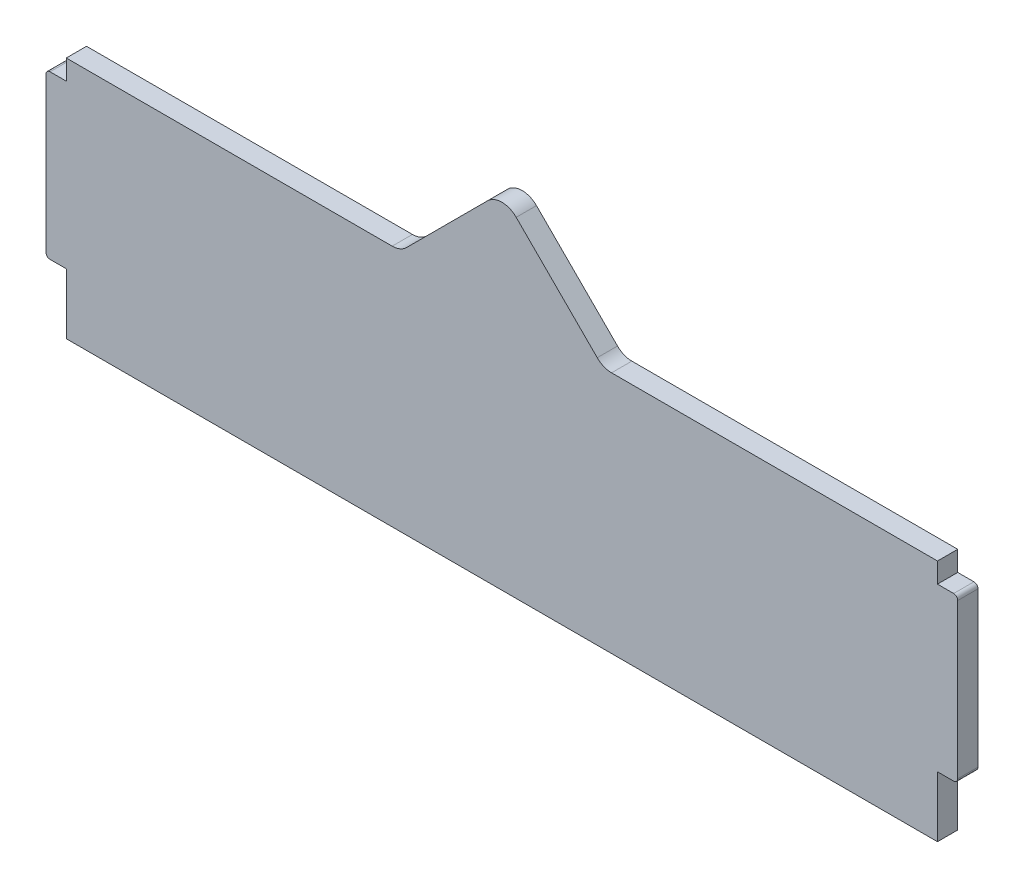
ISO-10303-21;
HEADER;
FILE_DESCRIPTION(('STEP AP214'),'2;1');
FILE_NAME('part.step','',(''),(''),'','','');
FILE_SCHEMA(('AUTOMOTIVE_DESIGN { 1 0 10303 214 1 1 1 1 }'));
ENDSEC;
DATA;
#1=APPLICATION_CONTEXT('core data for automotive mechanical design processes');
#2=APPLICATION_PROTOCOL_DEFINITION('international standard','automotive_design',2000,#1);
#3=PRODUCT_CONTEXT('',#1,'mechanical');
#4=PRODUCT('Part','Part','',(#3));
#5=PRODUCT_RELATED_PRODUCT_CATEGORY('part','',(#4));
#6=PRODUCT_DEFINITION_FORMATION('','',#4);
#7=PRODUCT_DEFINITION_CONTEXT('part definition',#1,'design');
#8=PRODUCT_DEFINITION('design','',#6,#7);
#9=PRODUCT_DEFINITION_SHAPE('','',#8);
#10=(LENGTH_UNIT() NAMED_UNIT(*) SI_UNIT(.MILLI.,.METRE.));
#11=(NAMED_UNIT(*) PLANE_ANGLE_UNIT() SI_UNIT($,.RADIAN.));
#12=(NAMED_UNIT(*) SI_UNIT($,.STERADIAN.) SOLID_ANGLE_UNIT());
#13=UNCERTAINTY_MEASURE_WITH_UNIT(LENGTH_MEASURE(1.E-05),#10,'distance_accuracy_value','');
#14=(GEOMETRIC_REPRESENTATION_CONTEXT(3) GLOBAL_UNCERTAINTY_ASSIGNED_CONTEXT((#13)) GLOBAL_UNIT_ASSIGNED_CONTEXT((#10,
#11,#12)) REPRESENTATION_CONTEXT('',''));
#15=CARTESIAN_POINT('',(0.,0.,0.));
#16=DIRECTION('',(0.,0.,1.));
#17=DIRECTION('',(1.,0.,0.));
#18=AXIS2_PLACEMENT_3D('',#15,#16,#17);
#19=CARTESIAN_POINT('',(0.,0.,5.));
#20=DIRECTION('',(1.,0.,0.));
#21=DIRECTION('',(0.,0.,-1.));
#22=AXIS2_PLACEMENT_3D('',#19,#20,#21);
#23=PLANE('',#22);
#24=DIRECTION('',(0.,-1.,0.));
#25=VECTOR('',#24,1.);
#26=CARTESIAN_POINT('',(0.,0.,0.));
#27=LINE('',#26,#25);
#28=CARTESIAN_POINT('',(0.,14.95,0.));
#29=VERTEX_POINT('',#28);
#30=CARTESIAN_POINT('',(0.,0.,0.));
#31=VERTEX_POINT('',#30);
#32=EDGE_CURVE('E211',#29,#31,#27,.T.);
#33=ORIENTED_EDGE('',*,*,#32,.T.);
#34=DIRECTION('',(0.,0.,-1.));
#35=VECTOR('',#34,1.);
#36=CARTESIAN_POINT('',(0.,0.,5.));
#37=LINE('',#36,#35);
#38=CARTESIAN_POINT('',(0.,0.,5.));
#39=VERTEX_POINT('',#38);
#40=EDGE_CURVE('E192',#39,#31,#37,.T.);
#41=ORIENTED_EDGE('',*,*,#40,.F.);
#42=DIRECTION('',(0.,-1.,0.));
#43=VECTOR('',#42,1.);
#44=CARTESIAN_POINT('',(0.,0.,5.));
#45=LINE('',#44,#43);
#46=CARTESIAN_POINT('',(0.,14.95,5.));
#47=VERTEX_POINT('',#46);
#48=EDGE_CURVE('E198',#47,#39,#45,.T.);
#49=ORIENTED_EDGE('',*,*,#48,.F.);
#50=DIRECTION('',(0.,0.,-1.));
#51=VECTOR('',#50,1.);
#52=CARTESIAN_POINT('',(0.,14.95,5.));
#53=LINE('',#52,#51);
#54=EDGE_CURVE('E325',#47,#29,#53,.T.);
#55=ORIENTED_EDGE('',*,*,#54,.T.);
#56=EDGE_LOOP('',(#33,#41,#49,#55));
#57=FACE_BOUND('',#56,.T.);
#58=ADVANCED_FACE('F37',(#57),#23,.F.);
#59=CARTESIAN_POINT('',(0.,0.,5.));
#60=DIRECTION('',(0.,1.,0.));
#61=DIRECTION('',(0.,0.,1.));
#62=AXIS2_PLACEMENT_3D('',#59,#60,#61);
#63=PLANE('',#62);
#64=DIRECTION('',(1.,0.,0.));
#65=VECTOR('',#64,1.);
#66=CARTESIAN_POINT('',(0.,0.,0.));
#67=LINE('',#66,#65);
#68=CARTESIAN_POINT('',(215.,0.,0.));
#69=VERTEX_POINT('',#68);
#70=EDGE_CURVE('E340',#31,#69,#67,.T.);
#71=ORIENTED_EDGE('',*,*,#70,.T.);
#72=DIRECTION('',(0.,0.,-1.));
#73=VECTOR('',#72,1.);
#74=CARTESIAN_POINT('',(215.,0.,5.));
#75=LINE('',#74,#73);
#76=CARTESIAN_POINT('',(215.,0.,5.));
#77=VERTEX_POINT('',#76);
#78=EDGE_CURVE('E195',#77,#69,#75,.T.);
#79=ORIENTED_EDGE('',*,*,#78,.F.);
#80=DIRECTION('',(1.,0.,0.));
#81=VECTOR('',#80,1.);
#82=CARTESIAN_POINT('',(0.,0.,5.));
#83=LINE('',#82,#81);
#84=EDGE_CURVE('E188',#39,#77,#83,.T.);
#85=ORIENTED_EDGE('',*,*,#84,.F.);
#86=ORIENTED_EDGE('',*,*,#40,.T.);
#87=EDGE_LOOP('',(#71,#79,#85,#86));
#88=FACE_BOUND('',#87,.T.);
#89=ADVANCED_FACE('F190',(#88),#63,.F.);
#90=CARTESIAN_POINT('',(215.,0.,5.));
#91=DIRECTION('',(-1.,0.,0.));
#92=DIRECTION('',(0.,0.,1.));
#93=AXIS2_PLACEMENT_3D('',#90,#91,#92);
#94=PLANE('',#93);
#95=DIRECTION('',(0.,1.,0.));
#96=VECTOR('',#95,1.);
#97=CARTESIAN_POINT('',(215.,0.,0.));
#98=LINE('',#97,#96);
#99=CARTESIAN_POINT('',(215.,14.95,0.));
#100=VERTEX_POINT('',#99);
#101=EDGE_CURVE('E300',#69,#100,#98,.T.);
#102=ORIENTED_EDGE('',*,*,#101,.T.);
#103=DIRECTION('',(0.,0.,-1.));
#104=VECTOR('',#103,1.);
#105=CARTESIAN_POINT('',(215.,14.95,5.));
#106=LINE('',#105,#104);
#107=CARTESIAN_POINT('',(215.,14.95,5.));
#108=VERTEX_POINT('',#107);
#109=EDGE_CURVE('E217',#108,#100,#106,.T.);
#110=ORIENTED_EDGE('',*,*,#109,.F.);
#111=DIRECTION('',(0.,1.,0.));
#112=VECTOR('',#111,1.);
#113=CARTESIAN_POINT('',(215.,0.,5.));
#114=LINE('',#113,#112);
#115=EDGE_CURVE('E197',#77,#108,#114,.T.);
#116=ORIENTED_EDGE('',*,*,#115,.F.);
#117=ORIENTED_EDGE('',*,*,#78,.T.);
#118=EDGE_LOOP('',(#102,#110,#116,#117));
#119=FACE_BOUND('',#118,.T.);
#120=ADVANCED_FACE('F449',(#119),#94,.F.);
#121=CARTESIAN_POINT('',(215.,14.95,5.));
#122=DIRECTION('',(0.,1.,0.));
#123=DIRECTION('',(0.,0.,1.));
#124=AXIS2_PLACEMENT_3D('',#121,#122,#123);
#125=PLANE('',#124);
#126=DIRECTION('',(1.,0.,0.));
#127=VECTOR('',#126,1.);
#128=CARTESIAN_POINT('',(215.,14.95,0.));
#129=LINE('',#128,#127);
#130=CARTESIAN_POINT('',(219.,14.95,0.));
#131=VERTEX_POINT('',#130);
#132=EDGE_CURVE('E281',#100,#131,#129,.T.);
#133=ORIENTED_EDGE('',*,*,#132,.T.);
#134=DIRECTION('',(0.,0.,-1.));
#135=VECTOR('',#134,1.);
#136=CARTESIAN_POINT('',(219.,14.95,5.));
#137=LINE('',#136,#135);
#138=CARTESIAN_POINT('',(219.,14.95,5.));
#139=VERTEX_POINT('',#138);
#140=EDGE_CURVE('E45',#131,#139,#137,.F.);
#141=ORIENTED_EDGE('',*,*,#140,.T.);
#142=DIRECTION('',(1.,0.,0.));
#143=VECTOR('',#142,1.);
#144=CARTESIAN_POINT('',(215.,14.95,5.));
#145=LINE('',#144,#143);
#146=EDGE_CURVE('E279',#108,#139,#145,.T.);
#147=ORIENTED_EDGE('',*,*,#146,.F.);
#148=ORIENTED_EDGE('',*,*,#109,.T.);
#149=EDGE_LOOP('',(#133,#141,#147,#148));
#150=FACE_BOUND('',#149,.T.);
#151=ADVANCED_FACE('F277',(#150),#125,.F.);
#152=CARTESIAN_POINT('',(220.,55.05,5.));
#153=DIRECTION('',(-1.,0.,0.));
#154=DIRECTION('',(0.,0.,1.));
#155=AXIS2_PLACEMENT_3D('',#152,#153,#154);
#156=PLANE('',#155);
#157=DIRECTION('',(0.,1.,0.));
#158=VECTOR('',#157,1.);
#159=CARTESIAN_POINT('',(220.,55.05,5.));
#160=LINE('',#159,#158);
#161=CARTESIAN_POINT('',(220.,15.95,5.));
#162=VERTEX_POINT('',#161);
#163=CARTESIAN_POINT('',(220.,54.05,5.));
#164=VERTEX_POINT('',#163);
#165=EDGE_CURVE('E285',#162,#164,#160,.T.);
#166=ORIENTED_EDGE('',*,*,#165,.F.);
#167=DIRECTION('',(0.,0.,-1.));
#168=VECTOR('',#167,1.);
#169=CARTESIAN_POINT('',(220.,15.95,5.));
#170=LINE('',#169,#168);
#171=CARTESIAN_POINT('',(220.,15.95,0.));
#172=VERTEX_POINT('',#171);
#173=EDGE_CURVE('E270',#162,#172,#170,.T.);
#174=ORIENTED_EDGE('',*,*,#173,.T.);
#175=DIRECTION('',(0.,1.,0.));
#176=VECTOR('',#175,1.);
#177=CARTESIAN_POINT('',(220.,55.05,0.));
#178=LINE('',#177,#176);
#179=CARTESIAN_POINT('',(220.,54.05,0.));
#180=VERTEX_POINT('',#179);
#181=EDGE_CURVE('E291',#172,#180,#178,.T.);
#182=ORIENTED_EDGE('',*,*,#181,.T.);
#183=DIRECTION('',(0.,0.,-1.));
#184=VECTOR('',#183,1.);
#185=CARTESIAN_POINT('',(220.,54.05,5.));
#186=LINE('',#185,#184);
#187=EDGE_CURVE('E60',#180,#164,#186,.F.);
#188=ORIENTED_EDGE('',*,*,#187,.T.);
#189=EDGE_LOOP('',(#166,#174,#182,#188));
#190=FACE_BOUND('',#189,.T.);
#191=ADVANCED_FACE('F290',(#190),#156,.F.);
#192=CARTESIAN_POINT('',(215.,55.05,5.));
#193=DIRECTION('',(0.,-1.,0.));
#194=DIRECTION('',(0.,0.,-1.));
#195=AXIS2_PLACEMENT_3D('',#192,#193,#194);
#196=PLANE('',#195);
#197=DIRECTION('',(-1.,0.,0.));
#198=VECTOR('',#197,1.);
#199=CARTESIAN_POINT('',(215.,55.05,5.));
#200=LINE('',#199,#198);
#201=CARTESIAN_POINT('',(219.,55.05,5.));
#202=VERTEX_POINT('',#201);
#203=CARTESIAN_POINT('',(215.,55.05,5.));
#204=VERTEX_POINT('',#203);
#205=EDGE_CURVE('E365',#202,#204,#200,.T.);
#206=ORIENTED_EDGE('',*,*,#205,.F.);
#207=DIRECTION('',(0.,0.,-1.));
#208=VECTOR('',#207,1.);
#209=CARTESIAN_POINT('',(219.,55.05,5.));
#210=LINE('',#209,#208);
#211=CARTESIAN_POINT('',(219.,55.05,0.));
#212=VERTEX_POINT('',#211);
#213=EDGE_CURVE('E11',#202,#212,#210,.T.);
#214=ORIENTED_EDGE('',*,*,#213,.T.);
#215=DIRECTION('',(-1.,0.,0.));
#216=VECTOR('',#215,1.);
#217=CARTESIAN_POINT('',(215.,55.05,0.));
#218=LINE('',#217,#216);
#219=CARTESIAN_POINT('',(215.,55.05,0.));
#220=VERTEX_POINT('',#219);
#221=EDGE_CURVE('E296',#212,#220,#218,.T.);
#222=ORIENTED_EDGE('',*,*,#221,.T.);
#223=DIRECTION('',(0.,0.,-1.));
#224=VECTOR('',#223,1.);
#225=CARTESIAN_POINT('',(215.,55.05,5.));
#226=LINE('',#225,#224);
#227=EDGE_CURVE('E336',#204,#220,#226,.T.);
#228=ORIENTED_EDGE('',*,*,#227,.F.);
#229=EDGE_LOOP('',(#206,#214,#222,#228));
#230=FACE_BOUND('',#229,.T.);
#231=ADVANCED_FACE('F371',(#230),#196,.F.);
#232=CARTESIAN_POINT('',(215.,55.05,5.));
#233=DIRECTION('',(-1.,0.,0.));
#234=DIRECTION('',(0.,0.,1.));
#235=AXIS2_PLACEMENT_3D('',#232,#233,#234);
#236=PLANE('',#235);
#237=DIRECTION('',(0.,1.,0.));
#238=VECTOR('',#237,1.);
#239=CARTESIAN_POINT('',(215.,55.05,0.));
#240=LINE('',#239,#238);
#241=CARTESIAN_POINT('',(215.,60.,0.));
#242=VERTEX_POINT('',#241);
#243=EDGE_CURVE('E298',#220,#242,#240,.T.);
#244=ORIENTED_EDGE('',*,*,#243,.T.);
#245=DIRECTION('',(0.,0.,-1.));
#246=VECTOR('',#245,1.);
#247=CARTESIAN_POINT('',(215.,60.,5.));
#248=LINE('',#247,#246);
#249=CARTESIAN_POINT('',(215.,60.,5.));
#250=VERTEX_POINT('',#249);
#251=EDGE_CURVE('E333',#250,#242,#248,.T.);
#252=ORIENTED_EDGE('',*,*,#251,.F.);
#253=DIRECTION('',(0.,1.,0.));
#254=VECTOR('',#253,1.);
#255=CARTESIAN_POINT('',(215.,55.05,5.));
#256=LINE('',#255,#254);
#257=EDGE_CURVE('E363',#204,#250,#256,.T.);
#258=ORIENTED_EDGE('',*,*,#257,.F.);
#259=ORIENTED_EDGE('',*,*,#227,.T.);
#260=EDGE_LOOP('',(#244,#252,#258,#259));
#261=FACE_BOUND('',#260,.T.);
#262=ADVANCED_FACE('F377',(#261),#236,.F.);
#263=CARTESIAN_POINT('',(132.5,60.,5.));
#264=DIRECTION('',(0.,-1.,0.));
#265=DIRECTION('',(0.,0.,-1.));
#266=AXIS2_PLACEMENT_3D('',#263,#264,#265);
#267=PLANE('',#266);
#268=DIRECTION('',(-1.,0.,0.));
#269=VECTOR('',#268,1.);
#270=CARTESIAN_POINT('',(132.5,60.,0.));
#271=LINE('',#270,#269);
#272=CARTESIAN_POINT('',(134.571067811865,60.,0.));
#273=VERTEX_POINT('',#272);
#274=EDGE_CURVE('E305',#242,#273,#271,.T.);
#275=ORIENTED_EDGE('',*,*,#274,.T.);
#276=DIRECTION('',(0.,0.,-1.));
#277=VECTOR('',#276,1.);
#278=CARTESIAN_POINT('',(134.571067811865,60.,5.));
#279=LINE('',#278,#277);
#280=CARTESIAN_POINT('',(134.571067811865,60.,5.));
#281=VERTEX_POINT('',#280);
#282=EDGE_CURVE('E230',#273,#281,#279,.F.);
#283=ORIENTED_EDGE('',*,*,#282,.T.);
#284=DIRECTION('',(-1.,0.,0.));
#285=VECTOR('',#284,1.);
#286=CARTESIAN_POINT('',(132.5,60.,5.));
#287=LINE('',#286,#285);
#288=EDGE_CURVE('E360',#250,#281,#287,.T.);
#289=ORIENTED_EDGE('',*,*,#288,.F.);
#290=ORIENTED_EDGE('',*,*,#251,.T.);
#291=EDGE_LOOP('',(#275,#283,#289,#290));
#292=FACE_BOUND('',#291,.T.);
#293=ADVANCED_FACE('F381',(#292),#267,.F.);
#294=CARTESIAN_POINT('',(107.5,85.,5.));
#295=DIRECTION('',(-0.707106781186548,-0.707106781186547,0.));
#296=DIRECTION('',(0.707106781186547,-0.707106781186548,0.));
#297=AXIS2_PLACEMENT_3D('',#294,#295,#296);
#298=PLANE('',#297);
#299=DIRECTION('',(-0.707106781186547,0.707106781186548,0.));
#300=VECTOR('',#299,1.);
#301=CARTESIAN_POINT('',(107.5,85.,5.));
#302=LINE('',#301,#300);
#303=CARTESIAN_POINT('',(131.035533905933,61.4644660940673,5.));
#304=VERTEX_POINT('',#303);
#305=CARTESIAN_POINT('',(111.035533905933,81.4644660940672,5.));
#306=VERTEX_POINT('',#305);
#307=EDGE_CURVE('E357',#304,#306,#302,.T.);
#308=ORIENTED_EDGE('',*,*,#307,.F.);
#309=DIRECTION('',(0.,0.,-1.));
#310=VECTOR('',#309,1.);
#311=CARTESIAN_POINT('',(131.035533905933,61.4644660940673,0.));
#312=LINE('',#311,#310);
#313=CARTESIAN_POINT('',(131.035533905933,61.4644660940673,0.));
#314=VERTEX_POINT('',#313);
#315=EDGE_CURVE('E227',#304,#314,#312,.T.);
#316=ORIENTED_EDGE('',*,*,#315,.T.);
#317=DIRECTION('',(-0.707106781186547,0.707106781186548,0.));
#318=VECTOR('',#317,1.);
#319=CARTESIAN_POINT('',(107.5,85.,0.));
#320=LINE('',#319,#318);
#321=CARTESIAN_POINT('',(111.035533905933,81.4644660940672,0.));
#322=VERTEX_POINT('',#321);
#323=EDGE_CURVE('E308',#314,#322,#320,.T.);
#324=ORIENTED_EDGE('',*,*,#323,.T.);
#325=DIRECTION('',(0.,0.,-1.));
#326=VECTOR('',#325,1.);
#327=CARTESIAN_POINT('',(111.035533905933,81.4644660940672,5.));
#328=LINE('',#327,#326);
#329=EDGE_CURVE('E225',#322,#306,#328,.F.);
#330=ORIENTED_EDGE('',*,*,#329,.T.);
#331=EDGE_LOOP('',(#308,#316,#324,#330));
#332=FACE_BOUND('',#331,.T.);
#333=ADVANCED_FACE('F390',(#332),#298,.F.);
#334=CARTESIAN_POINT('',(82.5,60.,5.));
#335=DIRECTION('',(0.707106781186547,-0.707106781186548,0.));
#336=DIRECTION('',(0.707106781186548,0.707106781186547,0.));
#337=AXIS2_PLACEMENT_3D('',#334,#335,#336);
#338=PLANE('',#337);
#339=DIRECTION('',(-0.707106781186548,-0.707106781186547,0.));
#340=VECTOR('',#339,1.);
#341=CARTESIAN_POINT('',(82.5,60.,0.));
#342=LINE('',#341,#340);
#343=CARTESIAN_POINT('',(103.964466094067,81.4644660940672,0.));
#344=VERTEX_POINT('',#343);
#345=CARTESIAN_POINT('',(83.9644660940673,61.4644660940673,0.));
#346=VERTEX_POINT('',#345);
#347=EDGE_CURVE('E311',#344,#346,#342,.T.);
#348=ORIENTED_EDGE('',*,*,#347,.T.);
#349=DIRECTION('',(0.,0.,-1.));
#350=VECTOR('',#349,1.);
#351=CARTESIAN_POINT('',(83.9644660940673,61.4644660940673,5.));
#352=LINE('',#351,#350);
#353=CARTESIAN_POINT('',(83.9644660940673,61.4644660940673,5.));
#354=VERTEX_POINT('',#353);
#355=EDGE_CURVE('E223',#346,#354,#352,.F.);
#356=ORIENTED_EDGE('',*,*,#355,.T.);
#357=DIRECTION('',(-0.707106781186548,-0.707106781186547,0.));
#358=VECTOR('',#357,1.);
#359=CARTESIAN_POINT('',(82.5,60.,5.));
#360=LINE('',#359,#358);
#361=CARTESIAN_POINT('',(103.964466094067,81.4644660940672,5.));
#362=VERTEX_POINT('',#361);
#363=EDGE_CURVE('E354',#362,#354,#360,.T.);
#364=ORIENTED_EDGE('',*,*,#363,.F.);
#365=DIRECTION('',(0.,0.,-1.));
#366=VECTOR('',#365,1.);
#367=CARTESIAN_POINT('',(103.964466094067,81.4644660940672,5.));
#368=LINE('',#367,#366);
#369=EDGE_CURVE('E215',#362,#344,#368,.T.);
#370=ORIENTED_EDGE('',*,*,#369,.T.);
#371=EDGE_LOOP('',(#348,#356,#364,#370));
#372=FACE_BOUND('',#371,.T.);
#373=ADVANCED_FACE('F399',(#372),#338,.F.);
#374=CARTESIAN_POINT('',(0.,60.,5.));
#375=DIRECTION('',(0.,-1.,0.));
#376=DIRECTION('',(0.,0.,-1.));
#377=AXIS2_PLACEMENT_3D('',#374,#375,#376);
#378=PLANE('',#377);
#379=DIRECTION('',(-1.,0.,0.));
#380=VECTOR('',#379,1.);
#381=CARTESIAN_POINT('',(0.,60.,5.));
#382=LINE('',#381,#380);
#383=CARTESIAN_POINT('',(80.4289321881345,60.,5.));
#384=VERTEX_POINT('',#383);
#385=CARTESIAN_POINT('',(0.,60.,5.));
#386=VERTEX_POINT('',#385);
#387=EDGE_CURVE('E352',#384,#386,#382,.T.);
#388=ORIENTED_EDGE('',*,*,#387,.F.);
#389=DIRECTION('',(0.,0.,-1.));
#390=VECTOR('',#389,1.);
#391=CARTESIAN_POINT('',(80.4289321881345,60.,0.));
#392=LINE('',#391,#390);
#393=CARTESIAN_POINT('',(80.4289321881345,60.,0.));
#394=VERTEX_POINT('',#393);
#395=EDGE_CURVE('E212',#384,#394,#392,.T.);
#396=ORIENTED_EDGE('',*,*,#395,.T.);
#397=DIRECTION('',(-1.,0.,0.));
#398=VECTOR('',#397,1.);
#399=CARTESIAN_POINT('',(0.,60.,0.));
#400=LINE('',#399,#398);
#401=CARTESIAN_POINT('',(0.,60.,0.));
#402=VERTEX_POINT('',#401);
#403=EDGE_CURVE('E314',#394,#402,#400,.T.);
#404=ORIENTED_EDGE('',*,*,#403,.T.);
#405=DIRECTION('',(0.,0.,-1.));
#406=VECTOR('',#405,1.);
#407=CARTESIAN_POINT('',(0.,60.,5.));
#408=LINE('',#407,#406);
#409=EDGE_CURVE('E330',#386,#402,#408,.T.);
#410=ORIENTED_EDGE('',*,*,#409,.F.);
#411=EDGE_LOOP('',(#388,#396,#404,#410));
#412=FACE_BOUND('',#411,.T.);
#413=ADVANCED_FACE('F408',(#412),#378,.F.);
#414=CARTESIAN_POINT('',(0.,55.05,5.));
#415=DIRECTION('',(1.,0.,0.));
#416=DIRECTION('',(0.,0.,-1.));
#417=AXIS2_PLACEMENT_3D('',#414,#415,#416);
#418=PLANE('',#417);
#419=DIRECTION('',(0.,-1.,0.));
#420=VECTOR('',#419,1.);
#421=CARTESIAN_POINT('',(0.,55.05,0.));
#422=LINE('',#421,#420);
#423=CARTESIAN_POINT('',(0.,55.05,0.));
#424=VERTEX_POINT('',#423);
#425=EDGE_CURVE('E316',#402,#424,#422,.T.);
#426=ORIENTED_EDGE('',*,*,#425,.T.);
#427=DIRECTION('',(0.,0.,-1.));
#428=VECTOR('',#427,1.);
#429=CARTESIAN_POINT('',(0.,55.05,5.));
#430=LINE('',#429,#428);
#431=CARTESIAN_POINT('',(0.,55.05,5.));
#432=VERTEX_POINT('',#431);
#433=EDGE_CURVE('E327',#432,#424,#430,.T.);
#434=ORIENTED_EDGE('',*,*,#433,.F.);
#435=DIRECTION('',(0.,-1.,0.));
#436=VECTOR('',#435,1.);
#437=CARTESIAN_POINT('',(0.,55.05,5.));
#438=LINE('',#437,#436);
#439=EDGE_CURVE('E350',#386,#432,#438,.T.);
#440=ORIENTED_EDGE('',*,*,#439,.F.);
#441=ORIENTED_EDGE('',*,*,#409,.T.);
#442=EDGE_LOOP('',(#426,#434,#440,#441));
#443=FACE_BOUND('',#442,.T.);
#444=ADVANCED_FACE('F414',(#443),#418,.F.);
#445=CARTESIAN_POINT('',(0.,55.05,5.));
#446=DIRECTION('',(0.,-1.,0.));
#447=DIRECTION('',(0.,0.,-1.));
#448=AXIS2_PLACEMENT_3D('',#445,#446,#447);
#449=PLANE('',#448);
#450=DIRECTION('',(-1.,0.,0.));
#451=VECTOR('',#450,1.);
#452=CARTESIAN_POINT('',(0.,55.05,0.));
#453=LINE('',#452,#451);
#454=CARTESIAN_POINT('',(-4.,55.05,0.));
#455=VERTEX_POINT('',#454);
#456=EDGE_CURVE('E318',#424,#455,#453,.T.);
#457=ORIENTED_EDGE('',*,*,#456,.T.);
#458=DIRECTION('',(0.,0.,-1.));
#459=VECTOR('',#458,1.);
#460=CARTESIAN_POINT('',(-4.,55.05,5.));
#461=LINE('',#460,#459);
#462=CARTESIAN_POINT('',(-4.,55.05,5.));
#463=VERTEX_POINT('',#462);
#464=EDGE_CURVE('E257',#455,#463,#461,.F.);
#465=ORIENTED_EDGE('',*,*,#464,.T.);
#466=DIRECTION('',(-1.,0.,0.));
#467=VECTOR('',#466,1.);
#468=CARTESIAN_POINT('',(0.,55.05,5.));
#469=LINE('',#468,#467);
#470=EDGE_CURVE('E348',#432,#463,#469,.T.);
#471=ORIENTED_EDGE('',*,*,#470,.F.);
#472=ORIENTED_EDGE('',*,*,#433,.T.);
#473=EDGE_LOOP('',(#457,#465,#471,#472));
#474=FACE_BOUND('',#473,.T.);
#475=ADVANCED_FACE('F418',(#474),#449,.F.);
#476=CARTESIAN_POINT('',(-5.,55.05,5.));
#477=DIRECTION('',(1.,0.,0.));
#478=DIRECTION('',(0.,1.,0.));
#479=AXIS2_PLACEMENT_3D('',#476,#477,#478);
#480=PLANE('',#479);
#481=DIRECTION('',(0.,-1.,0.));
#482=VECTOR('',#481,1.);
#483=CARTESIAN_POINT('',(-5.,55.05,5.));
#484=LINE('',#483,#482);
#485=CARTESIAN_POINT('',(-5.,54.05,5.));
#486=VERTEX_POINT('',#485);
#487=CARTESIAN_POINT('',(-4.99999999999999,15.95,5.));
#488=VERTEX_POINT('',#487);
#489=EDGE_CURVE('E345',#486,#488,#484,.T.);
#490=ORIENTED_EDGE('',*,*,#489,.F.);
#491=DIRECTION('',(0.,0.,-1.));
#492=VECTOR('',#491,1.);
#493=CARTESIAN_POINT('',(-5.,54.05,5.));
#494=LINE('',#493,#492);
#495=CARTESIAN_POINT('',(-5.,54.05,0.));
#496=VERTEX_POINT('',#495);
#497=EDGE_CURVE('E246',#486,#496,#494,.T.);
#498=ORIENTED_EDGE('',*,*,#497,.T.);
#499=DIRECTION('',(0.,-1.,0.));
#500=VECTOR('',#499,1.);
#501=CARTESIAN_POINT('',(-5.,55.05,0.));
#502=LINE('',#501,#500);
#503=CARTESIAN_POINT('',(-4.99999999999999,15.95,0.));
#504=VERTEX_POINT('',#503);
#505=EDGE_CURVE('E321',#496,#504,#502,.T.);
#506=ORIENTED_EDGE('',*,*,#505,.T.);
#507=DIRECTION('',(0.,0.,-1.));
#508=VECTOR('',#507,1.);
#509=CARTESIAN_POINT('',(-4.99999999999999,15.95,5.));
#510=LINE('',#509,#508);
#511=EDGE_CURVE('E244',#504,#488,#510,.F.);
#512=ORIENTED_EDGE('',*,*,#511,.T.);
#513=EDGE_LOOP('',(#490,#498,#506,#512));
#514=FACE_BOUND('',#513,.T.);
#515=ADVANCED_FACE('F426',(#514),#480,.F.);
#516=CARTESIAN_POINT('',(0.,14.95,5.));
#517=DIRECTION('',(0.,1.,0.));
#518=DIRECTION('',(0.,0.,1.));
#519=AXIS2_PLACEMENT_3D('',#516,#517,#518);
#520=PLANE('',#519);
#521=DIRECTION('',(1.,0.,0.));
#522=VECTOR('',#521,1.);
#523=CARTESIAN_POINT('',(0.,14.95,5.));
#524=LINE('',#523,#522);
#525=CARTESIAN_POINT('',(-3.99999999999999,14.95,5.));
#526=VERTEX_POINT('',#525);
#527=EDGE_CURVE('E204',#526,#47,#524,.T.);
#528=ORIENTED_EDGE('',*,*,#527,.F.);
#529=DIRECTION('',(0.,0.,-1.));
#530=VECTOR('',#529,1.);
#531=CARTESIAN_POINT('',(-3.99999999999999,14.95,5.));
#532=LINE('',#531,#530);
#533=CARTESIAN_POINT('',(-3.99999999999999,14.95,0.));
#534=VERTEX_POINT('',#533);
#535=EDGE_CURVE('E266',#526,#534,#532,.T.);
#536=ORIENTED_EDGE('',*,*,#535,.T.);
#537=DIRECTION('',(1.,0.,0.));
#538=VECTOR('',#537,1.);
#539=CARTESIAN_POINT('',(0.,14.95,0.));
#540=LINE('',#539,#538);
#541=EDGE_CURVE('E208',#534,#29,#540,.T.);
#542=ORIENTED_EDGE('',*,*,#541,.T.);
#543=ORIENTED_EDGE('',*,*,#54,.F.);
#544=EDGE_LOOP('',(#528,#536,#542,#543));
#545=FACE_BOUND('',#544,.T.);
#546=ADVANCED_FACE('F434',(#545),#520,.F.);
#547=CARTESIAN_POINT('',(0.,0.,5.));
#548=DIRECTION('',(0.,0.,1.));
#549=DIRECTION('',(1.,0.,0.));
#550=AXIS2_PLACEMENT_3D('',#547,#548,#549);
#551=PLANE('',#550);
#552=ORIENTED_EDGE('',*,*,#470,.T.);
#553=CARTESIAN_POINT('',(-4.,54.05,5.));
#554=DIRECTION('',(0.,0.,1.));
#555=DIRECTION('',(1.,0.,0.));
#556=AXIS2_PLACEMENT_3D('',#553,#554,#555);
#557=CIRCLE('',#556,1.);
#558=EDGE_CURVE('E264',#463,#486,#557,.T.);
#559=ORIENTED_EDGE('',*,*,#558,.T.);
#560=ORIENTED_EDGE('',*,*,#489,.T.);
#561=CARTESIAN_POINT('',(-3.99999999999999,15.95,5.));
#562=DIRECTION('',(0.,0.,1.));
#563=DIRECTION('',(1.,0.,0.));
#564=AXIS2_PLACEMENT_3D('',#561,#562,#563);
#565=CIRCLE('',#564,1.);
#566=EDGE_CURVE('E262',#488,#526,#565,.T.);
#567=ORIENTED_EDGE('',*,*,#566,.T.);
#568=ORIENTED_EDGE('',*,*,#527,.T.);
#569=ORIENTED_EDGE('',*,*,#48,.T.);
#570=ORIENTED_EDGE('',*,*,#84,.T.);
#571=ORIENTED_EDGE('',*,*,#115,.T.);
#572=ORIENTED_EDGE('',*,*,#146,.T.);
#573=CARTESIAN_POINT('',(219.,15.95,5.));
#574=DIRECTION('',(0.,0.,1.));
#575=DIRECTION('',(1.,0.,0.));
#576=AXIS2_PLACEMENT_3D('',#573,#574,#575);
#577=CIRCLE('',#576,1.);
#578=EDGE_CURVE('E260',#139,#162,#577,.T.);
#579=ORIENTED_EDGE('',*,*,#578,.T.);
#580=ORIENTED_EDGE('',*,*,#165,.T.);
#581=CARTESIAN_POINT('',(219.,54.05,5.));
#582=DIRECTION('',(0.,0.,1.));
#583=DIRECTION('',(1.,0.,0.));
#584=AXIS2_PLACEMENT_3D('',#581,#582,#583);
#585=CIRCLE('',#584,1.);
#586=EDGE_CURVE('E52',#164,#202,#585,.T.);
#587=ORIENTED_EDGE('',*,*,#586,.T.);
#588=ORIENTED_EDGE('',*,*,#205,.T.);
#589=ORIENTED_EDGE('',*,*,#257,.T.);
#590=ORIENTED_EDGE('',*,*,#288,.T.);
#591=CARTESIAN_POINT('',(134.571067811865,65.,5.));
#592=DIRECTION('',(0.,0.,1.));
#593=DIRECTION('',(1.,0.,0.));
#594=AXIS2_PLACEMENT_3D('',#591,#592,#593);
#595=CIRCLE('',#594,5.);
#596=EDGE_CURVE('E242',#281,#304,#595,.F.);
#597=ORIENTED_EDGE('',*,*,#596,.T.);
#598=ORIENTED_EDGE('',*,*,#307,.T.);
#599=CARTESIAN_POINT('',(107.5,77.9289321881345,5.));
#600=DIRECTION('',(0.,0.,1.));
#601=DIRECTION('',(1.,0.,0.));
#602=AXIS2_PLACEMENT_3D('',#599,#600,#601);
#603=CIRCLE('',#602,5.);
#604=EDGE_CURVE('E234',#306,#362,#603,.T.);
#605=ORIENTED_EDGE('',*,*,#604,.T.);
#606=ORIENTED_EDGE('',*,*,#363,.T.);
#607=CARTESIAN_POINT('',(80.4289321881345,65.,5.));
#608=DIRECTION('',(0.,0.,1.));
#609=DIRECTION('',(1.,0.,0.));
#610=AXIS2_PLACEMENT_3D('',#607,#608,#609);
#611=CIRCLE('',#610,5.);
#612=EDGE_CURVE('E238',#354,#384,#611,.F.);
#613=ORIENTED_EDGE('',*,*,#612,.T.);
#614=ORIENTED_EDGE('',*,*,#387,.T.);
#615=ORIENTED_EDGE('',*,*,#439,.T.);
#616=EDGE_LOOP('',(#552,#559,#560,#567,#568,#569,#570,#571,#572,#579,#580,#587,#588,#589,#590,
#597,#598,#605,#606,#613,#614,#615));
#617=FACE_BOUND('',#616,.T.);
#618=ADVANCED_FACE('F202',(#617),#551,.T.);
#619=CARTESIAN_POINT('',(0.,0.,0.));
#620=DIRECTION('',(0.,0.,1.));
#621=DIRECTION('',(1.,0.,0.));
#622=AXIS2_PLACEMENT_3D('',#619,#620,#621);
#623=PLANE('',#622);
#624=ORIENTED_EDGE('',*,*,#505,.F.);
#625=CARTESIAN_POINT('',(-4.,54.05,0.));
#626=DIRECTION('',(0.,0.,1.));
#627=DIRECTION('',(1.,0.,0.));
#628=AXIS2_PLACEMENT_3D('',#625,#626,#627);
#629=CIRCLE('',#628,1.);
#630=EDGE_CURVE('E255',#496,#455,#629,.F.);
#631=ORIENTED_EDGE('',*,*,#630,.T.);
#632=ORIENTED_EDGE('',*,*,#456,.F.);
#633=ORIENTED_EDGE('',*,*,#425,.F.);
#634=ORIENTED_EDGE('',*,*,#403,.F.);
#635=CARTESIAN_POINT('',(80.4289321881345,65.,0.));
#636=DIRECTION('',(0.,0.,1.));
#637=DIRECTION('',(1.,0.,0.));
#638=AXIS2_PLACEMENT_3D('',#635,#636,#637);
#639=CIRCLE('',#638,5.);
#640=EDGE_CURVE('E236',#394,#346,#639,.T.);
#641=ORIENTED_EDGE('',*,*,#640,.T.);
#642=ORIENTED_EDGE('',*,*,#347,.F.);
#643=CARTESIAN_POINT('',(107.5,77.9289321881345,0.));
#644=DIRECTION('',(0.,0.,1.));
#645=DIRECTION('',(1.,0.,0.));
#646=AXIS2_PLACEMENT_3D('',#643,#644,#645);
#647=CIRCLE('',#646,5.);
#648=EDGE_CURVE('E232',#344,#322,#647,.F.);
#649=ORIENTED_EDGE('',*,*,#648,.T.);
#650=ORIENTED_EDGE('',*,*,#323,.F.);
#651=CARTESIAN_POINT('',(134.571067811865,65.,0.));
#652=DIRECTION('',(0.,0.,1.));
#653=DIRECTION('',(1.,0.,0.));
#654=AXIS2_PLACEMENT_3D('',#651,#652,#653);
#655=CIRCLE('',#654,5.);
#656=EDGE_CURVE('E240',#314,#273,#655,.T.);
#657=ORIENTED_EDGE('',*,*,#656,.T.);
#658=ORIENTED_EDGE('',*,*,#274,.F.);
#659=ORIENTED_EDGE('',*,*,#243,.F.);
#660=ORIENTED_EDGE('',*,*,#221,.F.);
#661=CARTESIAN_POINT('',(219.,54.05,0.));
#662=DIRECTION('',(0.,0.,1.));
#663=DIRECTION('',(1.,0.,0.));
#664=AXIS2_PLACEMENT_3D('',#661,#662,#663);
#665=CIRCLE('',#664,1.);
#666=EDGE_CURVE('E249',#212,#180,#665,.F.);
#667=ORIENTED_EDGE('',*,*,#666,.T.);
#668=ORIENTED_EDGE('',*,*,#181,.F.);
#669=CARTESIAN_POINT('',(219.,15.95,0.));
#670=DIRECTION('',(0.,0.,1.));
#671=DIRECTION('',(1.,0.,0.));
#672=AXIS2_PLACEMENT_3D('',#669,#670,#671);
#673=CIRCLE('',#672,1.);
#674=EDGE_CURVE('E251',#172,#131,#673,.F.);
#675=ORIENTED_EDGE('',*,*,#674,.T.);
#676=ORIENTED_EDGE('',*,*,#132,.F.);
#677=ORIENTED_EDGE('',*,*,#101,.F.);
#678=ORIENTED_EDGE('',*,*,#70,.F.);
#679=ORIENTED_EDGE('',*,*,#32,.F.);
#680=ORIENTED_EDGE('',*,*,#541,.F.);
#681=CARTESIAN_POINT('',(-3.99999999999999,15.95,0.));
#682=DIRECTION('',(0.,0.,1.));
#683=DIRECTION('',(1.,0.,0.));
#684=AXIS2_PLACEMENT_3D('',#681,#682,#683);
#685=CIRCLE('',#684,1.);
#686=EDGE_CURVE('E253',#534,#504,#685,.F.);
#687=ORIENTED_EDGE('',*,*,#686,.T.);
#688=EDGE_LOOP('',(#624,#631,#632,#633,#634,#641,#642,#649,#650,#657,#658,#659,#660,#667,#668,
#675,#676,#677,#678,#679,#680,#687));
#689=FACE_BOUND('',#688,.T.);
#690=ADVANCED_FACE('F294',(#689),#623,.F.);
#691=CARTESIAN_POINT('',(80.4289321881345,65.,5.));
#692=DIRECTION('',(0.,0.,1.));
#693=DIRECTION('',(1.,0.,0.));
#694=AXIS2_PLACEMENT_3D('',#691,#692,#693);
#695=CYLINDRICAL_SURFACE('',#694,5.);
#696=ORIENTED_EDGE('',*,*,#612,.F.);
#697=ORIENTED_EDGE('',*,*,#355,.F.);
#698=ORIENTED_EDGE('',*,*,#640,.F.);
#699=ORIENTED_EDGE('',*,*,#395,.F.);
#700=EDGE_LOOP('',(#696,#697,#698,#699));
#701=FACE_BOUND('',#700,.T.);
#702=ADVANCED_FACE('F405',(#701),#695,.F.);
#703=CARTESIAN_POINT('',(134.571067811865,65.,5.));
#704=DIRECTION('',(0.,0.,1.));
#705=DIRECTION('',(1.,0.,0.));
#706=AXIS2_PLACEMENT_3D('',#703,#704,#705);
#707=CYLINDRICAL_SURFACE('',#706,5.);
#708=ORIENTED_EDGE('',*,*,#596,.F.);
#709=ORIENTED_EDGE('',*,*,#282,.F.);
#710=ORIENTED_EDGE('',*,*,#656,.F.);
#711=ORIENTED_EDGE('',*,*,#315,.F.);
#712=EDGE_LOOP('',(#708,#709,#710,#711));
#713=FACE_BOUND('',#712,.T.);
#714=ADVANCED_FACE('F387',(#713),#707,.F.);
#715=CARTESIAN_POINT('',(107.5,77.9289321881345,5.));
#716=DIRECTION('',(0.,0.,-1.));
#717=DIRECTION('',(-1.,0.,0.));
#718=AXIS2_PLACEMENT_3D('',#715,#716,#717);
#719=CYLINDRICAL_SURFACE('',#718,5.);
#720=ORIENTED_EDGE('',*,*,#604,.F.);
#721=ORIENTED_EDGE('',*,*,#329,.F.);
#722=ORIENTED_EDGE('',*,*,#648,.F.);
#723=ORIENTED_EDGE('',*,*,#369,.F.);
#724=EDGE_LOOP('',(#720,#721,#722,#723));
#725=FACE_BOUND('',#724,.T.);
#726=ADVANCED_FACE('F396',(#725),#719,.T.);
#727=CARTESIAN_POINT('',(-4.,54.05,5.));
#728=DIRECTION('',(0.,0.,-1.));
#729=DIRECTION('',(-1.,0.,0.));
#730=AXIS2_PLACEMENT_3D('',#727,#728,#729);
#731=CYLINDRICAL_SURFACE('',#730,1.);
#732=ORIENTED_EDGE('',*,*,#558,.F.);
#733=ORIENTED_EDGE('',*,*,#464,.F.);
#734=ORIENTED_EDGE('',*,*,#630,.F.);
#735=ORIENTED_EDGE('',*,*,#497,.F.);
#736=EDGE_LOOP('',(#732,#733,#734,#735));
#737=FACE_BOUND('',#736,.T.);
#738=ADVANCED_FACE('F424',(#737),#731,.T.);
#739=CARTESIAN_POINT('',(-3.99999999999999,15.95,5.));
#740=DIRECTION('',(0.,0.,-1.));
#741=DIRECTION('',(-1.,0.,0.));
#742=AXIS2_PLACEMENT_3D('',#739,#740,#741);
#743=CYLINDRICAL_SURFACE('',#742,1.);
#744=ORIENTED_EDGE('',*,*,#566,.F.);
#745=ORIENTED_EDGE('',*,*,#511,.F.);
#746=ORIENTED_EDGE('',*,*,#686,.F.);
#747=ORIENTED_EDGE('',*,*,#535,.F.);
#748=EDGE_LOOP('',(#744,#745,#746,#747));
#749=FACE_BOUND('',#748,.T.);
#750=ADVANCED_FACE('F432',(#749),#743,.T.);
#751=CARTESIAN_POINT('',(219.,15.95,5.));
#752=DIRECTION('',(0.,0.,-1.));
#753=DIRECTION('',(-1.,0.,0.));
#754=AXIS2_PLACEMENT_3D('',#751,#752,#753);
#755=CYLINDRICAL_SURFACE('',#754,1.);
#756=ORIENTED_EDGE('',*,*,#578,.F.);
#757=ORIENTED_EDGE('',*,*,#140,.F.);
#758=ORIENTED_EDGE('',*,*,#674,.F.);
#759=ORIENTED_EDGE('',*,*,#173,.F.);
#760=EDGE_LOOP('',(#756,#757,#758,#759));
#761=FACE_BOUND('',#760,.T.);
#762=ADVANCED_FACE('F288',(#761),#755,.T.);
#763=CARTESIAN_POINT('',(219.,54.05,5.));
#764=DIRECTION('',(0.,0.,-1.));
#765=DIRECTION('',(-1.,0.,0.));
#766=AXIS2_PLACEMENT_3D('',#763,#764,#765);
#767=CYLINDRICAL_SURFACE('',#766,1.);
#768=ORIENTED_EDGE('',*,*,#586,.F.);
#769=ORIENTED_EDGE('',*,*,#187,.F.);
#770=ORIENTED_EDGE('',*,*,#666,.F.);
#771=ORIENTED_EDGE('',*,*,#213,.F.);
#772=EDGE_LOOP('',(#768,#769,#770,#771));
#773=FACE_BOUND('',#772,.T.);
#774=ADVANCED_FACE('F39',(#773),#767,.T.);
#775=CLOSED_SHELL('',(#58,#89,#120,#151,#191,#231,#262,#293,#333,#373,#413,#444,#475,#515,#546,
#618,#690,#702,#714,#726,#738,#750,#762,#774));
#776=MANIFOLD_SOLID_BREP('B2',#775);
#777=ADVANCED_BREP_SHAPE_REPRESENTATION('',(#18,#776),#14);
#778=SHAPE_DEFINITION_REPRESENTATION(#9,#777);
ENDSEC;
END-ISO-10303-21;
